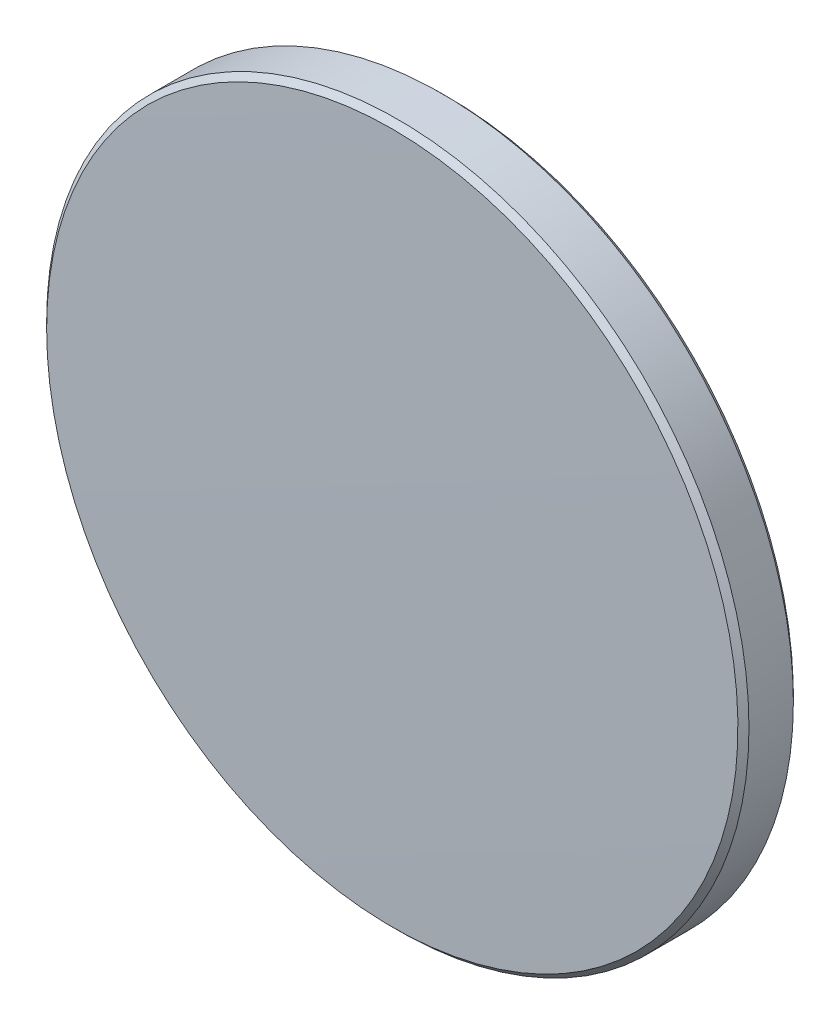
ISO-10303-21;
HEADER;
FILE_DESCRIPTION(('STEP AP214'),'2;1');
FILE_NAME('part.step','',(''),(''),'','','');
FILE_SCHEMA(('AUTOMOTIVE_DESIGN { 1 0 10303 214 1 1 1 1 }'));
ENDSEC;
DATA;
#1=APPLICATION_CONTEXT('core data for automotive mechanical design processes');
#2=APPLICATION_PROTOCOL_DEFINITION('international standard','automotive_design',2000,#1);
#3=PRODUCT_CONTEXT('',#1,'mechanical');
#4=PRODUCT('Part','Part','',(#3));
#5=PRODUCT_RELATED_PRODUCT_CATEGORY('part','',(#4));
#6=PRODUCT_DEFINITION_FORMATION('','',#4);
#7=PRODUCT_DEFINITION_CONTEXT('part definition',#1,'design');
#8=PRODUCT_DEFINITION('design','',#6,#7);
#9=PRODUCT_DEFINITION_SHAPE('','',#8);
#10=(LENGTH_UNIT() NAMED_UNIT(*) SI_UNIT(.MILLI.,.METRE.));
#11=(NAMED_UNIT(*) PLANE_ANGLE_UNIT() SI_UNIT($,.RADIAN.));
#12=(NAMED_UNIT(*) SI_UNIT($,.STERADIAN.) SOLID_ANGLE_UNIT());
#13=UNCERTAINTY_MEASURE_WITH_UNIT(LENGTH_MEASURE(1.E-05),#10,'distance_accuracy_value','');
#14=(GEOMETRIC_REPRESENTATION_CONTEXT(3) GLOBAL_UNCERTAINTY_ASSIGNED_CONTEXT((#13)) GLOBAL_UNIT_ASSIGNED_CONTEXT((#10,
#11,#12)) REPRESENTATION_CONTEXT('',''));
#15=CARTESIAN_POINT('',(0.,0.,0.));
#16=DIRECTION('',(0.,0.,1.));
#17=DIRECTION('',(1.,0.,0.));
#18=AXIS2_PLACEMENT_3D('',#15,#16,#17);
#19=CARTESIAN_POINT('',(0.,0.,-1.04));
#20=DIRECTION('',(0.,0.,-1.));
#21=DIRECTION('',(0.,1.,0.));
#22=AXIS2_PLACEMENT_3D('',#19,#20,#21);
#23=CYLINDRICAL_SURFACE('',#22,12.7);
#24=CARTESIAN_POINT('',(0.,0.,0.765733788212966));
#25=DIRECTION('',(0.,0.,-1.));
#26=DIRECTION('',(-1.,0.,0.));
#27=AXIS2_PLACEMENT_3D('',#24,#25,#26);
#28=CIRCLE('',#27,12.7);
#29=CARTESIAN_POINT('',(-12.7,0.,0.765733788212966));
#30=VERTEX_POINT('',#29);
#31=EDGE_CURVE('E28',#30,#30,#28,.T.);
#32=ORIENTED_EDGE('',*,*,#31,.T.);
#33=EDGE_LOOP('',(#32));
#34=FACE_BOUND('',#33,.T.);
#35=CARTESIAN_POINT('',(0.,0.,-0.84));
#36=DIRECTION('',(0.,0.,-1.));
#37=DIRECTION('',(-1.,0.,0.));
#38=AXIS2_PLACEMENT_3D('',#35,#36,#37);
#39=CIRCLE('',#38,12.7);
#40=CARTESIAN_POINT('',(-12.7,0.,-0.84));
#41=VERTEX_POINT('',#40);
#42=EDGE_CURVE('E20',#41,#41,#39,.T.);
#43=ORIENTED_EDGE('',*,*,#42,.F.);
#44=EDGE_LOOP('',(#43));
#45=FACE_BOUND('',#44,.T.);
#46=ADVANCED_FACE('F13',(#34,#45),#23,.T.);
#47=CARTESIAN_POINT('',(0.,0.,-0.84));
#48=DIRECTION('',(0.,0.,1.));
#49=DIRECTION('',(1.,0.,0.));
#50=AXIS2_PLACEMENT_3D('',#47,#48,#49);
#51=CONICAL_SURFACE('',#50,12.7,0.78539816339745);
#52=CARTESIAN_POINT('',(0.,0.,-1.04));
#53=DIRECTION('',(0.,0.,-1.));
#54=DIRECTION('',(-1.,0.,0.));
#55=AXIS2_PLACEMENT_3D('',#52,#53,#54);
#56=CIRCLE('',#55,12.5);
#57=CARTESIAN_POINT('',(-12.5,0.,-1.04));
#58=VERTEX_POINT('',#57);
#59=EDGE_CURVE('E9',#58,#58,#56,.T.);
#60=ORIENTED_EDGE('',*,*,#59,.F.);
#61=EDGE_LOOP('',(#60));
#62=FACE_BOUND('',#61,.T.);
#63=ORIENTED_EDGE('',*,*,#42,.T.);
#64=EDGE_LOOP('',(#63));
#65=FACE_BOUND('',#64,.T.);
#66=ADVANCED_FACE('F49',(#62,#65),#51,.T.);
#67=CARTESIAN_POINT('',(0.,0.,-1.04));
#68=DIRECTION('',(0.,0.,-1.));
#69=DIRECTION('',(0.,1.,0.));
#70=AXIS2_PLACEMENT_3D('',#67,#68,#69);
#71=PLANE('',#70);
#72=ORIENTED_EDGE('',*,*,#59,.T.);
#73=EDGE_LOOP('',(#72));
#74=FACE_BOUND('',#73,.T.);
#75=ADVANCED_FACE('F15',(#74),#71,.T.);
#76=CARTESIAN_POINT('',(0.,0.,0.965733788212965));
#77=DIRECTION('',(0.,0.,-1.));
#78=DIRECTION('',(-1.,0.,0.));
#79=AXIS2_PLACEMENT_3D('',#76,#77,#78);
#80=CONICAL_SURFACE('',#79,12.5,0.785398163397452);
#81=ORIENTED_EDGE('',*,*,#31,.F.);
#82=EDGE_LOOP('',(#81));
#83=FACE_BOUND('',#82,.T.);
#84=CARTESIAN_POINT('',(0.,0.,0.965733788212965));
#85=DIRECTION('',(0.,0.,-1.));
#86=DIRECTION('',(-1.,0.,0.));
#87=AXIS2_PLACEMENT_3D('',#84,#85,#86);
#88=CIRCLE('',#87,12.5);
#89=CARTESIAN_POINT('',(-12.5,0.,0.965733788212965));
#90=VERTEX_POINT('',#89);
#91=EDGE_CURVE('E24',#90,#90,#88,.T.);
#92=ORIENTED_EDGE('',*,*,#91,.T.);
#93=EDGE_LOOP('',(#92));
#94=FACE_BOUND('',#93,.T.);
#95=ADVANCED_FACE('F36',(#83,#94),#80,.T.);
#96=CARTESIAN_POINT('',(0.,1.28575829670685E-13,-1050.956));
#97=DIRECTION('',(0.,0.,-1.));
#98=DIRECTION('',(0.,1.,0.));
#99=AXIS2_PLACEMENT_3D('',#96,#97,#98);
#100=SPHERICAL_SURFACE('',#99,1051.996);
#101=ORIENTED_EDGE('',*,*,#91,.F.);
#102=EDGE_LOOP('',(#101));
#103=FACE_BOUND('',#102,.T.);
#104=ADVANCED_FACE('F39',(#103),#100,.T.);
#105=CLOSED_SHELL('',(#46,#66,#75,#95,#104));
#106=MANIFOLD_SOLID_BREP('B1',#105);
#107=ADVANCED_BREP_SHAPE_REPRESENTATION('',(#18,#106),#14);
#108=SHAPE_DEFINITION_REPRESENTATION(#9,#107);
ENDSEC;
END-ISO-10303-21;
